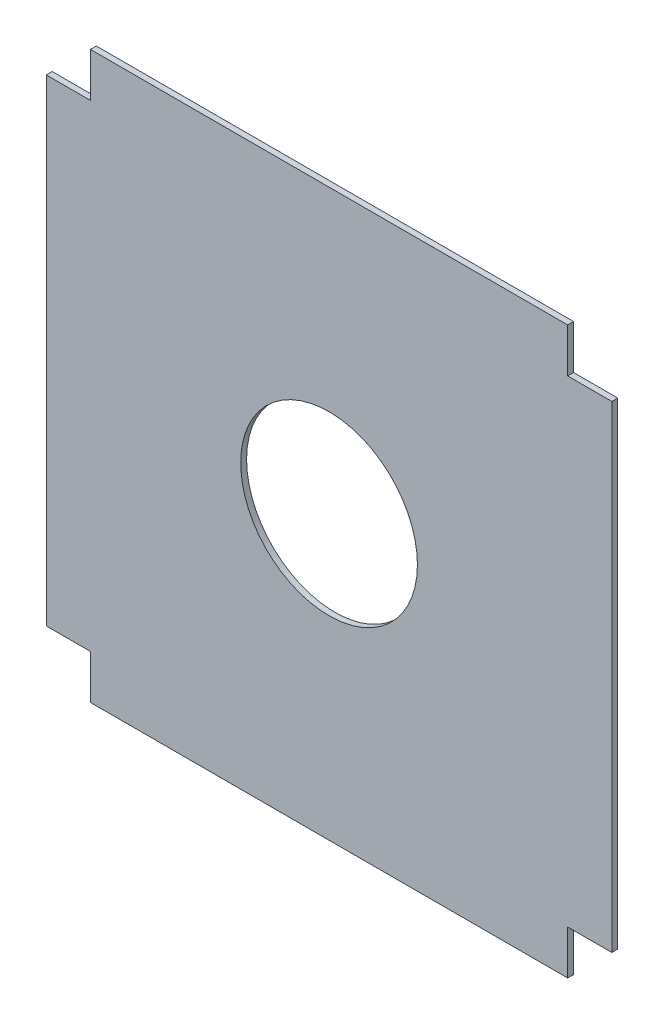
ISO-10303-21;
HEADER;
FILE_DESCRIPTION(('STEP AP214'),'2;1');
FILE_NAME('part.step','',(''),(''),'','','');
FILE_SCHEMA(('AUTOMOTIVE_DESIGN { 1 0 10303 214 1 1 1 1 }'));
ENDSEC;
DATA;
#1=APPLICATION_CONTEXT('core data for automotive mechanical design processes');
#2=APPLICATION_PROTOCOL_DEFINITION('international standard','automotive_design',2000,#1);
#3=PRODUCT_CONTEXT('',#1,'mechanical');
#4=PRODUCT('Part','Part','',(#3));
#5=PRODUCT_RELATED_PRODUCT_CATEGORY('part','',(#4));
#6=PRODUCT_DEFINITION_FORMATION('','',#4);
#7=PRODUCT_DEFINITION_CONTEXT('part definition',#1,'design');
#8=PRODUCT_DEFINITION('design','',#6,#7);
#9=PRODUCT_DEFINITION_SHAPE('','',#8);
#10=(LENGTH_UNIT() NAMED_UNIT(*) SI_UNIT(.MILLI.,.METRE.));
#11=(NAMED_UNIT(*) PLANE_ANGLE_UNIT() SI_UNIT($,.RADIAN.));
#12=(NAMED_UNIT(*) SI_UNIT($,.STERADIAN.) SOLID_ANGLE_UNIT());
#13=UNCERTAINTY_MEASURE_WITH_UNIT(LENGTH_MEASURE(1.E-05),#10,'distance_accuracy_value','');
#14=(GEOMETRIC_REPRESENTATION_CONTEXT(3) GLOBAL_UNCERTAINTY_ASSIGNED_CONTEXT((#13)) GLOBAL_UNIT_ASSIGNED_CONTEXT((#10,
#11,#12)) REPRESENTATION_CONTEXT('',''));
#15=CARTESIAN_POINT('',(0.,0.,0.));
#16=DIRECTION('',(0.,0.,1.));
#17=DIRECTION('',(1.,0.,0.));
#18=AXIS2_PLACEMENT_3D('',#15,#16,#17);
#19=CARTESIAN_POINT('',(-48.,-40.5,1.));
#20=DIRECTION('',(1.,0.,0.));
#21=DIRECTION('',(0.,0.,-1.));
#22=AXIS2_PLACEMENT_3D('',#19,#20,#21);
#23=PLANE('',#22);
#24=DIRECTION('',(0.,-1.,0.));
#25=VECTOR('',#24,1.);
#26=CARTESIAN_POINT('',(-48.,-40.5,0.));
#27=LINE('',#26,#25);
#28=CARTESIAN_POINT('',(-48.,40.5,0.));
#29=VERTEX_POINT('',#28);
#30=CARTESIAN_POINT('',(-48.,-40.5,0.));
#31=VERTEX_POINT('',#30);
#32=EDGE_CURVE('E164',#29,#31,#27,.T.);
#33=ORIENTED_EDGE('',*,*,#32,.T.);
#34=DIRECTION('',(0.,0.,-1.));
#35=VECTOR('',#34,1.);
#36=CARTESIAN_POINT('',(-48.,-40.5,1.));
#37=LINE('',#36,#35);
#38=CARTESIAN_POINT('',(-48.,-40.5,1.));
#39=VERTEX_POINT('',#38);
#40=EDGE_CURVE('E11',#39,#31,#37,.T.);
#41=ORIENTED_EDGE('',*,*,#40,.F.);
#42=DIRECTION('',(0.,-1.,0.));
#43=VECTOR('',#42,1.);
#44=CARTESIAN_POINT('',(-48.,-40.5,1.));
#45=LINE('',#44,#43);
#46=CARTESIAN_POINT('',(-48.,40.5,1.));
#47=VERTEX_POINT('',#46);
#48=EDGE_CURVE('E198',#47,#39,#45,.T.);
#49=ORIENTED_EDGE('',*,*,#48,.F.);
#50=DIRECTION('',(0.,0.,-1.));
#51=VECTOR('',#50,1.);
#52=CARTESIAN_POINT('',(-48.,40.5,1.));
#53=LINE('',#52,#51);
#54=EDGE_CURVE('E160',#47,#29,#53,.T.);
#55=ORIENTED_EDGE('',*,*,#54,.T.);
#56=EDGE_LOOP('',(#33,#41,#49,#55));
#57=FACE_BOUND('',#56,.T.);
#58=ADVANCED_FACE('F36',(#57),#23,.F.);
#59=CARTESIAN_POINT('',(-40.5,-40.5,1.));
#60=DIRECTION('',(0.,1.,0.));
#61=DIRECTION('',(0.,0.,1.));
#62=AXIS2_PLACEMENT_3D('',#59,#60,#61);
#63=PLANE('',#62);
#64=DIRECTION('',(1.,0.,0.));
#65=VECTOR('',#64,1.);
#66=CARTESIAN_POINT('',(-40.5,-40.5,0.));
#67=LINE('',#66,#65);
#68=CARTESIAN_POINT('',(-40.5,-40.5,0.));
#69=VERTEX_POINT('',#68);
#70=EDGE_CURVE('E168',#31,#69,#67,.T.);
#71=ORIENTED_EDGE('',*,*,#70,.T.);
#72=DIRECTION('',(0.,0.,-1.));
#73=VECTOR('',#72,1.);
#74=CARTESIAN_POINT('',(-40.5,-40.5,1.));
#75=LINE('',#74,#73);
#76=CARTESIAN_POINT('',(-40.5,-40.5,1.));
#77=VERTEX_POINT('',#76);
#78=EDGE_CURVE('E46',#77,#69,#75,.T.);
#79=ORIENTED_EDGE('',*,*,#78,.F.);
#80=DIRECTION('',(1.,0.,0.));
#81=VECTOR('',#80,1.);
#82=CARTESIAN_POINT('',(-40.5,-40.5,1.));
#83=LINE('',#82,#81);
#84=EDGE_CURVE('E109',#39,#77,#83,.T.);
#85=ORIENTED_EDGE('',*,*,#84,.F.);
#86=ORIENTED_EDGE('',*,*,#40,.T.);
#87=EDGE_LOOP('',(#71,#79,#85,#86));
#88=FACE_BOUND('',#87,.T.);
#89=ADVANCED_FACE('F283',(#88),#63,.F.);
#90=CARTESIAN_POINT('',(-40.5,-48.,1.));
#91=DIRECTION('',(1.,0.,0.));
#92=DIRECTION('',(0.,0.,-1.));
#93=AXIS2_PLACEMENT_3D('',#90,#91,#92);
#94=PLANE('',#93);
#95=DIRECTION('',(0.,-1.,0.));
#96=VECTOR('',#95,1.);
#97=CARTESIAN_POINT('',(-40.5,-48.,0.));
#98=LINE('',#97,#96);
#99=CARTESIAN_POINT('',(-40.5,-48.,0.));
#100=VERTEX_POINT('',#99);
#101=EDGE_CURVE('E171',#69,#100,#98,.T.);
#102=ORIENTED_EDGE('',*,*,#101,.T.);
#103=DIRECTION('',(0.,0.,-1.));
#104=VECTOR('',#103,1.);
#105=CARTESIAN_POINT('',(-40.5,-48.,1.));
#106=LINE('',#105,#104);
#107=CARTESIAN_POINT('',(-40.5,-48.,1.));
#108=VERTEX_POINT('',#107);
#109=EDGE_CURVE('E224',#108,#100,#106,.T.);
#110=ORIENTED_EDGE('',*,*,#109,.F.);
#111=DIRECTION('',(0.,-1.,0.));
#112=VECTOR('',#111,1.);
#113=CARTESIAN_POINT('',(-40.5,-48.,1.));
#114=LINE('',#113,#112);
#115=EDGE_CURVE('E235',#77,#108,#114,.T.);
#116=ORIENTED_EDGE('',*,*,#115,.F.);
#117=ORIENTED_EDGE('',*,*,#78,.T.);
#118=EDGE_LOOP('',(#102,#110,#116,#117));
#119=FACE_BOUND('',#118,.T.);
#120=ADVANCED_FACE('F233',(#119),#94,.F.);
#121=CARTESIAN_POINT('',(40.5,-48.,1.));
#122=DIRECTION('',(0.,1.,0.));
#123=DIRECTION('',(0.,0.,1.));
#124=AXIS2_PLACEMENT_3D('',#121,#122,#123);
#125=PLANE('',#124);
#126=DIRECTION('',(1.,0.,0.));
#127=VECTOR('',#126,1.);
#128=CARTESIAN_POINT('',(40.5,-48.,0.));
#129=LINE('',#128,#127);
#130=CARTESIAN_POINT('',(40.5,-48.,0.));
#131=VERTEX_POINT('',#130);
#132=EDGE_CURVE('E174',#100,#131,#129,.T.);
#133=ORIENTED_EDGE('',*,*,#132,.T.);
#134=DIRECTION('',(0.,0.,-1.));
#135=VECTOR('',#134,1.);
#136=CARTESIAN_POINT('',(40.5,-48.,1.));
#137=LINE('',#136,#135);
#138=CARTESIAN_POINT('',(40.5,-48.,1.));
#139=VERTEX_POINT('',#138);
#140=EDGE_CURVE('E220',#139,#131,#137,.T.);
#141=ORIENTED_EDGE('',*,*,#140,.F.);
#142=DIRECTION('',(1.,0.,0.));
#143=VECTOR('',#142,1.);
#144=CARTESIAN_POINT('',(40.5,-48.,1.));
#145=LINE('',#144,#143);
#146=EDGE_CURVE('E254',#108,#139,#145,.T.);
#147=ORIENTED_EDGE('',*,*,#146,.F.);
#148=ORIENTED_EDGE('',*,*,#109,.T.);
#149=EDGE_LOOP('',(#133,#141,#147,#148));
#150=FACE_BOUND('',#149,.T.);
#151=ADVANCED_FACE('F244',(#150),#125,.F.);
#152=CARTESIAN_POINT('',(40.5,-40.5,1.));
#153=DIRECTION('',(-1.,0.,0.));
#154=DIRECTION('',(0.,0.,1.));
#155=AXIS2_PLACEMENT_3D('',#152,#153,#154);
#156=PLANE('',#155);
#157=DIRECTION('',(0.,1.,0.));
#158=VECTOR('',#157,1.);
#159=CARTESIAN_POINT('',(40.5,-40.5,0.));
#160=LINE('',#159,#158);
#161=CARTESIAN_POINT('',(40.5,-40.5,0.));
#162=VERTEX_POINT('',#161);
#163=EDGE_CURVE('E177',#131,#162,#160,.T.);
#164=ORIENTED_EDGE('',*,*,#163,.T.);
#165=DIRECTION('',(0.,0.,-1.));
#166=VECTOR('',#165,1.);
#167=CARTESIAN_POINT('',(40.5,-40.5,1.));
#168=LINE('',#167,#166);
#169=CARTESIAN_POINT('',(40.5,-40.5,1.));
#170=VERTEX_POINT('',#169);
#171=EDGE_CURVE('E216',#170,#162,#168,.T.);
#172=ORIENTED_EDGE('',*,*,#171,.F.);
#173=DIRECTION('',(0.,1.,0.));
#174=VECTOR('',#173,1.);
#175=CARTESIAN_POINT('',(40.5,-40.5,1.));
#176=LINE('',#175,#174);
#177=EDGE_CURVE('E250',#139,#170,#176,.T.);
#178=ORIENTED_EDGE('',*,*,#177,.F.);
#179=ORIENTED_EDGE('',*,*,#140,.T.);
#180=EDGE_LOOP('',(#164,#172,#178,#179));
#181=FACE_BOUND('',#180,.T.);
#182=ADVANCED_FACE('F248',(#181),#156,.F.);
#183=CARTESIAN_POINT('',(48.,-40.5,1.));
#184=DIRECTION('',(0.,1.,0.));
#185=DIRECTION('',(0.,0.,1.));
#186=AXIS2_PLACEMENT_3D('',#183,#184,#185);
#187=PLANE('',#186);
#188=DIRECTION('',(1.,0.,0.));
#189=VECTOR('',#188,1.);
#190=CARTESIAN_POINT('',(48.,-40.5,0.));
#191=LINE('',#190,#189);
#192=CARTESIAN_POINT('',(48.,-40.5,0.));
#193=VERTEX_POINT('',#192);
#194=EDGE_CURVE('E180',#162,#193,#191,.T.);
#195=ORIENTED_EDGE('',*,*,#194,.T.);
#196=DIRECTION('',(0.,0.,-1.));
#197=VECTOR('',#196,1.);
#198=CARTESIAN_POINT('',(48.,-40.5,1.));
#199=LINE('',#198,#197);
#200=CARTESIAN_POINT('',(48.,-40.5,1.));
#201=VERTEX_POINT('',#200);
#202=EDGE_CURVE('E212',#201,#193,#199,.T.);
#203=ORIENTED_EDGE('',*,*,#202,.F.);
#204=DIRECTION('',(1.,0.,0.));
#205=VECTOR('',#204,1.);
#206=CARTESIAN_POINT('',(48.,-40.5,1.));
#207=LINE('',#206,#205);
#208=EDGE_CURVE('E253',#170,#201,#207,.T.);
#209=ORIENTED_EDGE('',*,*,#208,.F.);
#210=ORIENTED_EDGE('',*,*,#171,.T.);
#211=EDGE_LOOP('',(#195,#203,#209,#210));
#212=FACE_BOUND('',#211,.T.);
#213=ADVANCED_FACE('F295',(#212),#187,.F.);
#214=CARTESIAN_POINT('',(48.,40.5,1.));
#215=DIRECTION('',(-1.,0.,0.));
#216=DIRECTION('',(0.,0.,1.));
#217=AXIS2_PLACEMENT_3D('',#214,#215,#216);
#218=PLANE('',#217);
#219=DIRECTION('',(0.,1.,0.));
#220=VECTOR('',#219,1.);
#221=CARTESIAN_POINT('',(48.,40.5,0.));
#222=LINE('',#221,#220);
#223=CARTESIAN_POINT('',(48.,40.5,0.));
#224=VERTEX_POINT('',#223);
#225=EDGE_CURVE('E183',#193,#224,#222,.T.);
#226=ORIENTED_EDGE('',*,*,#225,.T.);
#227=DIRECTION('',(0.,0.,-1.));
#228=VECTOR('',#227,1.);
#229=CARTESIAN_POINT('',(48.,40.5,1.));
#230=LINE('',#229,#228);
#231=CARTESIAN_POINT('',(48.,40.5,1.));
#232=VERTEX_POINT('',#231);
#233=EDGE_CURVE('E208',#232,#224,#230,.T.);
#234=ORIENTED_EDGE('',*,*,#233,.F.);
#235=DIRECTION('',(0.,1.,0.));
#236=VECTOR('',#235,1.);
#237=CARTESIAN_POINT('',(48.,40.5,1.));
#238=LINE('',#237,#236);
#239=EDGE_CURVE('E258',#201,#232,#238,.T.);
#240=ORIENTED_EDGE('',*,*,#239,.F.);
#241=ORIENTED_EDGE('',*,*,#202,.T.);
#242=EDGE_LOOP('',(#226,#234,#240,#241));
#243=FACE_BOUND('',#242,.T.);
#244=ADVANCED_FACE('F298',(#243),#218,.F.);
#245=CARTESIAN_POINT('',(40.5,40.5,1.));
#246=DIRECTION('',(0.,-1.,0.));
#247=DIRECTION('',(0.,0.,-1.));
#248=AXIS2_PLACEMENT_3D('',#245,#246,#247);
#249=PLANE('',#248);
#250=DIRECTION('',(-1.,0.,0.));
#251=VECTOR('',#250,1.);
#252=CARTESIAN_POINT('',(40.5,40.5,0.));
#253=LINE('',#252,#251);
#254=CARTESIAN_POINT('',(40.5,40.5,0.));
#255=VERTEX_POINT('',#254);
#256=EDGE_CURVE('E186',#224,#255,#253,.T.);
#257=ORIENTED_EDGE('',*,*,#256,.T.);
#258=DIRECTION('',(0.,0.,-1.));
#259=VECTOR('',#258,1.);
#260=CARTESIAN_POINT('',(40.5,40.5,1.));
#261=LINE('',#260,#259);
#262=CARTESIAN_POINT('',(40.5,40.5,1.));
#263=VERTEX_POINT('',#262);
#264=EDGE_CURVE('E204',#263,#255,#261,.T.);
#265=ORIENTED_EDGE('',*,*,#264,.F.);
#266=DIRECTION('',(-1.,0.,0.));
#267=VECTOR('',#266,1.);
#268=CARTESIAN_POINT('',(40.5,40.5,1.));
#269=LINE('',#268,#267);
#270=EDGE_CURVE('E265',#232,#263,#269,.T.);
#271=ORIENTED_EDGE('',*,*,#270,.F.);
#272=ORIENTED_EDGE('',*,*,#233,.T.);
#273=EDGE_LOOP('',(#257,#265,#271,#272));
#274=FACE_BOUND('',#273,.T.);
#275=ADVANCED_FACE('F302',(#274),#249,.F.);
#276=CARTESIAN_POINT('',(40.5,48.,1.));
#277=DIRECTION('',(-1.,0.,0.));
#278=DIRECTION('',(0.,0.,1.));
#279=AXIS2_PLACEMENT_3D('',#276,#277,#278);
#280=PLANE('',#279);
#281=DIRECTION('',(0.,1.,0.));
#282=VECTOR('',#281,1.);
#283=CARTESIAN_POINT('',(40.5,48.,0.));
#284=LINE('',#283,#282);
#285=CARTESIAN_POINT('',(40.5,48.,0.));
#286=VERTEX_POINT('',#285);
#287=EDGE_CURVE('E189',#255,#286,#284,.T.);
#288=ORIENTED_EDGE('',*,*,#287,.T.);
#289=DIRECTION('',(0.,0.,-1.));
#290=VECTOR('',#289,1.);
#291=CARTESIAN_POINT('',(40.5,48.,1.));
#292=LINE('',#291,#290);
#293=CARTESIAN_POINT('',(40.5,48.,1.));
#294=VERTEX_POINT('',#293);
#295=EDGE_CURVE('E151',#294,#286,#292,.T.);
#296=ORIENTED_EDGE('',*,*,#295,.F.);
#297=DIRECTION('',(0.,1.,0.));
#298=VECTOR('',#297,1.);
#299=CARTESIAN_POINT('',(40.5,48.,1.));
#300=LINE('',#299,#298);
#301=EDGE_CURVE('E140',#263,#294,#300,.T.);
#302=ORIENTED_EDGE('',*,*,#301,.F.);
#303=ORIENTED_EDGE('',*,*,#264,.T.);
#304=EDGE_LOOP('',(#288,#296,#302,#303));
#305=FACE_BOUND('',#304,.T.);
#306=ADVANCED_FACE('F306',(#305),#280,.F.);
#307=CARTESIAN_POINT('',(-40.5,48.,1.));
#308=DIRECTION('',(0.,-1.,0.));
#309=DIRECTION('',(0.,0.,-1.));
#310=AXIS2_PLACEMENT_3D('',#307,#308,#309);
#311=PLANE('',#310);
#312=DIRECTION('',(-1.,0.,0.));
#313=VECTOR('',#312,1.);
#314=CARTESIAN_POINT('',(-40.5,48.,0.));
#315=LINE('',#314,#313);
#316=CARTESIAN_POINT('',(-40.5,48.,0.));
#317=VERTEX_POINT('',#316);
#318=EDGE_CURVE('E149',#286,#317,#315,.T.);
#319=ORIENTED_EDGE('',*,*,#318,.T.);
#320=DIRECTION('',(0.,0.,-1.));
#321=VECTOR('',#320,1.);
#322=CARTESIAN_POINT('',(-40.5,48.,1.));
#323=LINE('',#322,#321);
#324=CARTESIAN_POINT('',(-40.5,48.,1.));
#325=VERTEX_POINT('',#324);
#326=EDGE_CURVE('E146',#325,#317,#323,.T.);
#327=ORIENTED_EDGE('',*,*,#326,.F.);
#328=DIRECTION('',(-1.,0.,0.));
#329=VECTOR('',#328,1.);
#330=CARTESIAN_POINT('',(-40.5,48.,1.));
#331=LINE('',#330,#329);
#332=EDGE_CURVE('E134',#294,#325,#331,.T.);
#333=ORIENTED_EDGE('',*,*,#332,.F.);
#334=ORIENTED_EDGE('',*,*,#295,.T.);
#335=EDGE_LOOP('',(#319,#327,#333,#334));
#336=FACE_BOUND('',#335,.T.);
#337=ADVANCED_FACE('F147',(#336),#311,.F.);
#338=CARTESIAN_POINT('',(-40.5,40.5,1.));
#339=DIRECTION('',(1.,0.,0.));
#340=DIRECTION('',(0.,0.,-1.));
#341=AXIS2_PLACEMENT_3D('',#338,#339,#340);
#342=PLANE('',#341);
#343=DIRECTION('',(0.,-1.,0.));
#344=VECTOR('',#343,1.);
#345=CARTESIAN_POINT('',(-40.5,40.5,0.));
#346=LINE('',#345,#344);
#347=CARTESIAN_POINT('',(-40.5,40.5,0.));
#348=VERTEX_POINT('',#347);
#349=EDGE_CURVE('E95',#317,#348,#346,.T.);
#350=ORIENTED_EDGE('',*,*,#349,.T.);
#351=DIRECTION('',(0.,0.,-1.));
#352=VECTOR('',#351,1.);
#353=CARTESIAN_POINT('',(-40.5,40.5,1.));
#354=LINE('',#353,#352);
#355=CARTESIAN_POINT('',(-40.5,40.5,1.));
#356=VERTEX_POINT('',#355);
#357=EDGE_CURVE('E152',#356,#348,#354,.T.);
#358=ORIENTED_EDGE('',*,*,#357,.F.);
#359=DIRECTION('',(0.,-1.,0.));
#360=VECTOR('',#359,1.);
#361=CARTESIAN_POINT('',(-40.5,40.5,1.));
#362=LINE('',#361,#360);
#363=EDGE_CURVE('E138',#325,#356,#362,.T.);
#364=ORIENTED_EDGE('',*,*,#363,.F.);
#365=ORIENTED_EDGE('',*,*,#326,.T.);
#366=EDGE_LOOP('',(#350,#358,#364,#365));
#367=FACE_BOUND('',#366,.T.);
#368=ADVANCED_FACE('F154',(#367),#342,.F.);
#369=CARTESIAN_POINT('',(-48.,40.5,1.));
#370=DIRECTION('',(0.,-1.,0.));
#371=DIRECTION('',(0.,0.,-1.));
#372=AXIS2_PLACEMENT_3D('',#369,#370,#371);
#373=PLANE('',#372);
#374=DIRECTION('',(-1.,0.,0.));
#375=VECTOR('',#374,1.);
#376=CARTESIAN_POINT('',(-48.,40.5,0.));
#377=LINE('',#376,#375);
#378=EDGE_CURVE('E101',#348,#29,#377,.T.);
#379=ORIENTED_EDGE('',*,*,#378,.T.);
#380=ORIENTED_EDGE('',*,*,#54,.F.);
#381=DIRECTION('',(-1.,0.,0.));
#382=VECTOR('',#381,1.);
#383=CARTESIAN_POINT('',(-48.,40.5,1.));
#384=LINE('',#383,#382);
#385=EDGE_CURVE('E54',#356,#47,#384,.T.);
#386=ORIENTED_EDGE('',*,*,#385,.F.);
#387=ORIENTED_EDGE('',*,*,#357,.T.);
#388=EDGE_LOOP('',(#379,#380,#386,#387));
#389=FACE_BOUND('',#388,.T.);
#390=ADVANCED_FACE('F315',(#389),#373,.F.);
#391=CARTESIAN_POINT('',(0.,0.,1.));
#392=DIRECTION('',(0.,0.,-1.));
#393=DIRECTION('',(-1.,0.,0.));
#394=AXIS2_PLACEMENT_3D('',#391,#392,#393);
#395=PLANE('',#394);
#396=CARTESIAN_POINT('',(0.,0.,1.));
#397=DIRECTION('',(0.,0.,1.));
#398=DIRECTION('',(1.,0.,0.));
#399=AXIS2_PLACEMENT_3D('',#396,#397,#398);
#400=CIRCLE('',#399,15.);
#401=CARTESIAN_POINT('',(15.,0.,1.));
#402=VERTEX_POINT('',#401);
#403=EDGE_CURVE('E270',#402,#402,#400,.T.);
#404=ORIENTED_EDGE('',*,*,#403,.F.);
#405=EDGE_LOOP('',(#404));
#406=FACE_BOUND('',#405,.T.);
#407=ORIENTED_EDGE('',*,*,#48,.T.);
#408=ORIENTED_EDGE('',*,*,#84,.T.);
#409=ORIENTED_EDGE('',*,*,#115,.T.);
#410=ORIENTED_EDGE('',*,*,#146,.T.);
#411=ORIENTED_EDGE('',*,*,#177,.T.);
#412=ORIENTED_EDGE('',*,*,#208,.T.);
#413=ORIENTED_EDGE('',*,*,#239,.T.);
#414=ORIENTED_EDGE('',*,*,#270,.T.);
#415=ORIENTED_EDGE('',*,*,#301,.T.);
#416=ORIENTED_EDGE('',*,*,#332,.T.);
#417=ORIENTED_EDGE('',*,*,#363,.T.);
#418=ORIENTED_EDGE('',*,*,#385,.T.);
#419=EDGE_LOOP('',(#407,#408,#409,#410,#411,#412,#413,#414,#415,#416,#417,#418));
#420=FACE_BOUND('',#419,.T.);
#421=ADVANCED_FACE('F136',(#406,#420),#395,.F.);
#422=CARTESIAN_POINT('',(0.,0.,0.));
#423=DIRECTION('',(0.,0.,-1.));
#424=DIRECTION('',(-1.,0.,0.));
#425=AXIS2_PLACEMENT_3D('',#422,#423,#424);
#426=PLANE('',#425);
#427=CARTESIAN_POINT('',(0.,0.,0.));
#428=DIRECTION('',(0.,0.,-1.));
#429=DIRECTION('',(-1.,0.,0.));
#430=AXIS2_PLACEMENT_3D('',#427,#428,#429);
#431=CIRCLE('',#430,15.);
#432=CARTESIAN_POINT('',(-15.,0.,0.));
#433=VERTEX_POINT('',#432);
#434=EDGE_CURVE('E39',#433,#433,#431,.T.);
#435=ORIENTED_EDGE('',*,*,#434,.F.);
#436=EDGE_LOOP('',(#435));
#437=FACE_BOUND('',#436,.T.);
#438=ORIENTED_EDGE('',*,*,#32,.F.);
#439=ORIENTED_EDGE('',*,*,#378,.F.);
#440=ORIENTED_EDGE('',*,*,#349,.F.);
#441=ORIENTED_EDGE('',*,*,#318,.F.);
#442=ORIENTED_EDGE('',*,*,#287,.F.);
#443=ORIENTED_EDGE('',*,*,#256,.F.);
#444=ORIENTED_EDGE('',*,*,#225,.F.);
#445=ORIENTED_EDGE('',*,*,#194,.F.);
#446=ORIENTED_EDGE('',*,*,#163,.F.);
#447=ORIENTED_EDGE('',*,*,#132,.F.);
#448=ORIENTED_EDGE('',*,*,#101,.F.);
#449=ORIENTED_EDGE('',*,*,#70,.F.);
#450=EDGE_LOOP('',(#438,#439,#440,#441,#442,#443,#444,#445,#446,#447,#448,#449));
#451=FACE_BOUND('',#450,.T.);
#452=ADVANCED_FACE('F239',(#437,#451),#426,.T.);
#453=CARTESIAN_POINT('',(0.,0.,-9.));
#454=DIRECTION('',(0.,0.,1.));
#455=DIRECTION('',(1.,0.,0.));
#456=AXIS2_PLACEMENT_3D('',#453,#454,#455);
#457=CYLINDRICAL_SURFACE('',#456,15.);
#458=ORIENTED_EDGE('',*,*,#434,.T.);
#459=EDGE_LOOP('',(#458));
#460=FACE_BOUND('',#459,.T.);
#461=ORIENTED_EDGE('',*,*,#403,.T.);
#462=EDGE_LOOP('',(#461));
#463=FACE_BOUND('',#462,.T.);
#464=ADVANCED_FACE('F320',(#460,#463),#457,.F.);
#465=CLOSED_SHELL('',(#58,#89,#120,#151,#182,#213,#244,#275,#306,#337,#368,#390,#421,#452,#464));
#466=MANIFOLD_SOLID_BREP('B2',#465);
#467=ADVANCED_BREP_SHAPE_REPRESENTATION('',(#18,#466),#14);
#468=SHAPE_DEFINITION_REPRESENTATION(#9,#467);
ENDSEC;
END-ISO-10303-21;
